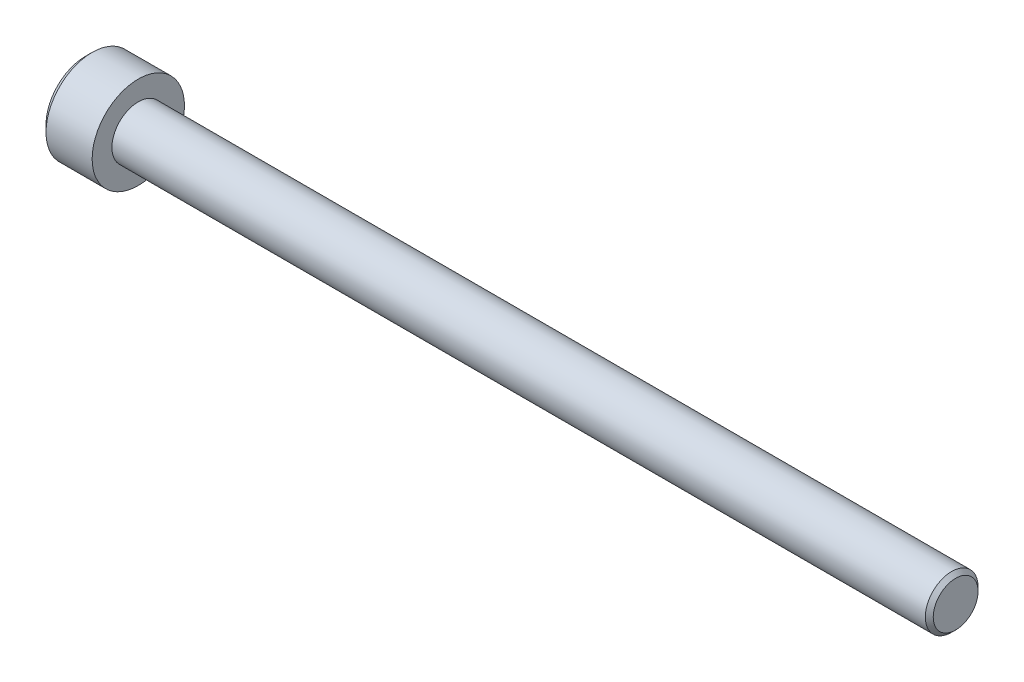
ISO-10303-21;
HEADER;
FILE_DESCRIPTION(('STEP AP214'),'2;1');
FILE_NAME('part.step','',(''),(''),'','','');
FILE_SCHEMA(('AUTOMOTIVE_DESIGN { 1 0 10303 214 1 1 1 1 }'));
ENDSEC;
DATA;
#1=APPLICATION_CONTEXT('core data for automotive mechanical design processes');
#2=APPLICATION_PROTOCOL_DEFINITION('international standard','automotive_design',2000,#1);
#3=PRODUCT_CONTEXT('',#1,'mechanical');
#4=PRODUCT('Part','Part','',(#3));
#5=PRODUCT_RELATED_PRODUCT_CATEGORY('part','',(#4));
#6=PRODUCT_DEFINITION_FORMATION('','',#4);
#7=PRODUCT_DEFINITION_CONTEXT('part definition',#1,'design');
#8=PRODUCT_DEFINITION('design','',#6,#7);
#9=PRODUCT_DEFINITION_SHAPE('','',#8);
#10=(LENGTH_UNIT() NAMED_UNIT(*) SI_UNIT(.MILLI.,.METRE.));
#11=(NAMED_UNIT(*) PLANE_ANGLE_UNIT() SI_UNIT($,.RADIAN.));
#12=(NAMED_UNIT(*) SI_UNIT($,.STERADIAN.) SOLID_ANGLE_UNIT());
#13=UNCERTAINTY_MEASURE_WITH_UNIT(LENGTH_MEASURE(1.E-05),#10,'distance_accuracy_value','');
#14=(GEOMETRIC_REPRESENTATION_CONTEXT(3) GLOBAL_UNCERTAINTY_ASSIGNED_CONTEXT((#13)) GLOBAL_UNIT_ASSIGNED_CONTEXT((#10,
#11,#12)) REPRESENTATION_CONTEXT('',''));
#15=CARTESIAN_POINT('',(0.,0.,0.));
#16=DIRECTION('',(0.,0.,1.));
#17=DIRECTION('',(1.,0.,0.));
#18=AXIS2_PLACEMENT_3D('',#15,#16,#17);
#19=CARTESIAN_POINT('',(0.,0.,0.));
#20=DIRECTION('',(1.,0.,0.));
#21=DIRECTION('',(0.,0.,-1.));
#22=AXIS2_PLACEMENT_3D('',#19,#20,#21);
#23=PLANE('',#22);
#24=CARTESIAN_POINT('',(0.,0.,0.));
#25=DIRECTION('',(1.,0.,0.));
#26=DIRECTION('',(0.,0.,-1.));
#27=AXIS2_PLACEMENT_3D('',#24,#25,#26);
#28=CIRCLE('',#27,3.);
#29=CARTESIAN_POINT('',(0.,0.,-3.));
#30=VERTEX_POINT('',#29);
#31=EDGE_CURVE('E53',#30,#30,#28,.F.);
#32=ORIENTED_EDGE('',*,*,#31,.T.);
#33=EDGE_LOOP('',(#32));
#34=FACE_BOUND('',#33,.T.);
#35=DIRECTION('',(0.,-0.5,-0.866025403784439));
#36=VECTOR('',#35,1.);
#37=CARTESIAN_POINT('',(0.,2.,0.));
#38=LINE('',#37,#36);
#39=CARTESIAN_POINT('',(0.,2.,0.));
#40=VERTEX_POINT('',#39);
#41=CARTESIAN_POINT('',(0.,1.,-1.73205080756888));
#42=VERTEX_POINT('',#41);
#43=EDGE_CURVE('E140',#40,#42,#38,.T.);
#44=ORIENTED_EDGE('',*,*,#43,.F.);
#45=DIRECTION('',(0.,0.5,-0.866025403784439));
#46=VECTOR('',#45,1.);
#47=CARTESIAN_POINT('',(0.,1.,1.73205080756888));
#48=LINE('',#47,#46);
#49=CARTESIAN_POINT('',(0.,1.,1.73205080756888));
#50=VERTEX_POINT('',#49);
#51=EDGE_CURVE('E60',#50,#40,#48,.T.);
#52=ORIENTED_EDGE('',*,*,#51,.F.);
#53=DIRECTION('',(0.,1.,0.));
#54=VECTOR('',#53,1.);
#55=CARTESIAN_POINT('',(0.,-1.,1.73205080756888));
#56=LINE('',#55,#54);
#57=CARTESIAN_POINT('',(0.,-1.,1.73205080756888));
#58=VERTEX_POINT('',#57);
#59=EDGE_CURVE('E153',#58,#50,#56,.T.);
#60=ORIENTED_EDGE('',*,*,#59,.F.);
#61=DIRECTION('',(0.,0.5,0.866025403784439));
#62=VECTOR('',#61,1.);
#63=CARTESIAN_POINT('',(0.,-2.,0.));
#64=LINE('',#63,#62);
#65=CARTESIAN_POINT('',(0.,-2.,0.));
#66=VERTEX_POINT('',#65);
#67=EDGE_CURVE('E150',#66,#58,#64,.T.);
#68=ORIENTED_EDGE('',*,*,#67,.F.);
#69=DIRECTION('',(0.,-0.5,0.866025403784439));
#70=VECTOR('',#69,1.);
#71=CARTESIAN_POINT('',(0.,-1.,-1.73205080756888));
#72=LINE('',#71,#70);
#73=CARTESIAN_POINT('',(0.,-1.,-1.73205080756888));
#74=VERTEX_POINT('',#73);
#75=EDGE_CURVE('E108',#74,#66,#72,.T.);
#76=ORIENTED_EDGE('',*,*,#75,.F.);
#77=DIRECTION('',(0.,-1.,0.));
#78=VECTOR('',#77,1.);
#79=CARTESIAN_POINT('',(0.,1.,-1.73205080756888));
#80=LINE('',#79,#78);
#81=EDGE_CURVE('E144',#42,#74,#80,.T.);
#82=ORIENTED_EDGE('',*,*,#81,.F.);
#83=EDGE_LOOP('',(#44,#52,#60,#68,#76,#82));
#84=FACE_BOUND('',#83,.T.);
#85=ADVANCED_FACE('F43',(#34,#84),#23,.F.);
#86=CARTESIAN_POINT('',(0.,0.,0.));
#87=DIRECTION('',(-1.,0.,0.));
#88=DIRECTION('',(0.,0.,1.));
#89=AXIS2_PLACEMENT_3D('',#86,#87,#88);
#90=CYLINDRICAL_SURFACE('',#89,3.5);
#91=CARTESIAN_POINT('',(0.50000000000001,0.,0.));
#92=DIRECTION('',(1.,0.,0.));
#93=DIRECTION('',(0.,0.,-1.));
#94=AXIS2_PLACEMENT_3D('',#91,#92,#93);
#95=CIRCLE('',#94,3.5);
#96=CARTESIAN_POINT('',(0.50000000000001,0.,-3.5));
#97=VERTEX_POINT('',#96);
#98=EDGE_CURVE('E11',#97,#97,#95,.T.);
#99=ORIENTED_EDGE('',*,*,#98,.T.);
#100=EDGE_LOOP('',(#99));
#101=FACE_BOUND('',#100,.T.);
#102=CARTESIAN_POINT('',(4.,0.,0.));
#103=DIRECTION('',(-1.,0.,0.));
#104=DIRECTION('',(0.,0.,1.));
#105=AXIS2_PLACEMENT_3D('',#102,#103,#104);
#106=CIRCLE('',#105,3.5);
#107=CARTESIAN_POINT('',(4.,0.,3.5));
#108=VERTEX_POINT('',#107);
#109=EDGE_CURVE('E172',#108,#108,#106,.T.);
#110=ORIENTED_EDGE('',*,*,#109,.T.);
#111=EDGE_LOOP('',(#110));
#112=FACE_BOUND('',#111,.T.);
#113=ADVANCED_FACE('F198',(#101,#112),#90,.T.);
#114=CARTESIAN_POINT('',(4.,3.5,0.));
#115=DIRECTION('',(-1.,0.,0.));
#116=DIRECTION('',(0.,0.,1.));
#117=AXIS2_PLACEMENT_3D('',#114,#115,#116);
#118=PLANE('',#117);
#119=ORIENTED_EDGE('',*,*,#109,.F.);
#120=EDGE_LOOP('',(#119));
#121=FACE_BOUND('',#120,.T.);
#122=CARTESIAN_POINT('',(4.,0.,0.));
#123=DIRECTION('',(-1.,0.,0.));
#124=DIRECTION('',(0.,0.,1.));
#125=AXIS2_PLACEMENT_3D('',#122,#123,#124);
#126=CIRCLE('',#125,2.);
#127=CARTESIAN_POINT('',(4.,0.,2.));
#128=VERTEX_POINT('',#127);
#129=EDGE_CURVE('E159',#128,#128,#126,.T.);
#130=ORIENTED_EDGE('',*,*,#129,.T.);
#131=EDGE_LOOP('',(#130));
#132=FACE_BOUND('',#131,.T.);
#133=ADVANCED_FACE('F203',(#121,#132),#118,.F.);
#134=CARTESIAN_POINT('',(0.,0.,0.));
#135=DIRECTION('',(-1.,0.,0.));
#136=DIRECTION('',(0.,0.,1.));
#137=AXIS2_PLACEMENT_3D('',#134,#135,#136);
#138=CYLINDRICAL_SURFACE('',#137,2.);
#139=CARTESIAN_POINT('',(65.7,0.,0.));
#140=DIRECTION('',(-1.,0.,0.));
#141=DIRECTION('',(0.,0.,1.));
#142=AXIS2_PLACEMENT_3D('',#139,#140,#141);
#143=CIRCLE('',#142,2.);
#144=CARTESIAN_POINT('',(65.7,0.,2.));
#145=VERTEX_POINT('',#144);
#146=EDGE_CURVE('E176',#145,#145,#143,.T.);
#147=ORIENTED_EDGE('',*,*,#146,.T.);
#148=EDGE_LOOP('',(#147));
#149=FACE_BOUND('',#148,.T.);
#150=ORIENTED_EDGE('',*,*,#129,.F.);
#151=EDGE_LOOP('',(#150));
#152=FACE_BOUND('',#151,.T.);
#153=ADVANCED_FACE('F221',(#149,#152),#138,.T.);
#154=CARTESIAN_POINT('',(66.,2.,0.));
#155=DIRECTION('',(-1.,0.,0.));
#156=DIRECTION('',(0.,0.,1.));
#157=AXIS2_PLACEMENT_3D('',#154,#155,#156);
#158=PLANE('',#157);
#159=CARTESIAN_POINT('',(66.,0.,0.));
#160=DIRECTION('',(-1.,0.,0.));
#161=DIRECTION('',(0.,0.,1.));
#162=AXIS2_PLACEMENT_3D('',#159,#160,#161);
#163=CIRCLE('',#162,1.70000000000001);
#164=CARTESIAN_POINT('',(66.,0.,1.70000000000001));
#165=VERTEX_POINT('',#164);
#166=EDGE_CURVE('E180',#165,#165,#163,.F.);
#167=ORIENTED_EDGE('',*,*,#166,.T.);
#168=EDGE_LOOP('',(#167));
#169=FACE_BOUND('',#168,.T.);
#170=ADVANCED_FACE('F213',(#169),#158,.F.);
#171=CARTESIAN_POINT('',(65.7,0.,0.));
#172=DIRECTION('',(-1.,0.,0.));
#173=DIRECTION('',(0.,0.,1.));
#174=AXIS2_PLACEMENT_3D('',#171,#172,#173);
#175=CONICAL_SURFACE('',#174,2.,0.785398163397457);
#176=ORIENTED_EDGE('',*,*,#166,.F.);
#177=EDGE_LOOP('',(#176));
#178=FACE_BOUND('',#177,.T.);
#179=ORIENTED_EDGE('',*,*,#146,.F.);
#180=EDGE_LOOP('',(#179));
#181=FACE_BOUND('',#180,.T.);
#182=ADVANCED_FACE('F208',(#178,#181),#175,.T.);
#183=CARTESIAN_POINT('',(1.,1.,1.73205080756888));
#184=DIRECTION('',(0.,0.866025403784439,0.5));
#185=DIRECTION('',(0.,-0.5,0.866025403784439));
#186=AXIS2_PLACEMENT_3D('',#183,#184,#185);
#187=PLANE('',#186);
#188=ORIENTED_EDGE('',*,*,#51,.T.);
#189=DIRECTION('',(-1.,0.,0.));
#190=VECTOR('',#189,1.);
#191=CARTESIAN_POINT('',(1.,2.,0.));
#192=LINE('',#191,#190);
#193=CARTESIAN_POINT('',(1.,2.,0.));
#194=VERTEX_POINT('',#193);
#195=EDGE_CURVE('E90',#194,#40,#192,.T.);
#196=ORIENTED_EDGE('',*,*,#195,.F.);
#197=DIRECTION('',(0.,0.5,-0.866025403784439));
#198=VECTOR('',#197,1.);
#199=CARTESIAN_POINT('',(1.,1.,1.73205080756888));
#200=LINE('',#199,#198);
#201=CARTESIAN_POINT('',(1.,1.,1.73205080756888));
#202=VERTEX_POINT('',#201);
#203=EDGE_CURVE('E156',#202,#194,#200,.T.);
#204=ORIENTED_EDGE('',*,*,#203,.F.);
#205=DIRECTION('',(-1.,0.,0.));
#206=VECTOR('',#205,1.);
#207=CARTESIAN_POINT('',(1.,1.,1.73205080756888));
#208=LINE('',#207,#206);
#209=EDGE_CURVE('E68',#202,#50,#208,.T.);
#210=ORIENTED_EDGE('',*,*,#209,.T.);
#211=EDGE_LOOP('',(#188,#196,#204,#210));
#212=FACE_BOUND('',#211,.T.);
#213=ADVANCED_FACE('F212',(#212),#187,.F.);
#214=CARTESIAN_POINT('',(1.,-1.,1.73205080756888));
#215=DIRECTION('',(0.,0.,1.));
#216=DIRECTION('',(1.,0.,0.));
#217=AXIS2_PLACEMENT_3D('',#214,#215,#216);
#218=PLANE('',#217);
#219=ORIENTED_EDGE('',*,*,#59,.T.);
#220=ORIENTED_EDGE('',*,*,#209,.F.);
#221=DIRECTION('',(0.,1.,0.));
#222=VECTOR('',#221,1.);
#223=CARTESIAN_POINT('',(1.,-1.,1.73205080756888));
#224=LINE('',#223,#222);
#225=CARTESIAN_POINT('',(1.,-1.,1.73205080756888));
#226=VERTEX_POINT('',#225);
#227=EDGE_CURVE('E122',#226,#202,#224,.T.);
#228=ORIENTED_EDGE('',*,*,#227,.F.);
#229=DIRECTION('',(-1.,0.,0.));
#230=VECTOR('',#229,1.);
#231=CARTESIAN_POINT('',(1.,-1.,1.73205080756888));
#232=LINE('',#231,#230);
#233=EDGE_CURVE('E113',#226,#58,#232,.T.);
#234=ORIENTED_EDGE('',*,*,#233,.T.);
#235=EDGE_LOOP('',(#219,#220,#228,#234));
#236=FACE_BOUND('',#235,.T.);
#237=ADVANCED_FACE('F219',(#236),#218,.F.);
#238=CARTESIAN_POINT('',(1.,-2.,0.));
#239=DIRECTION('',(0.,-0.866025403784439,0.5));
#240=DIRECTION('',(0.,-0.5,-0.866025403784439));
#241=AXIS2_PLACEMENT_3D('',#238,#239,#240);
#242=PLANE('',#241);
#243=ORIENTED_EDGE('',*,*,#67,.T.);
#244=ORIENTED_EDGE('',*,*,#233,.F.);
#245=DIRECTION('',(0.,0.5,0.866025403784439));
#246=VECTOR('',#245,1.);
#247=CARTESIAN_POINT('',(1.,-2.,0.));
#248=LINE('',#247,#246);
#249=CARTESIAN_POINT('',(1.,-2.,0.));
#250=VERTEX_POINT('',#249);
#251=EDGE_CURVE('E117',#250,#226,#248,.T.);
#252=ORIENTED_EDGE('',*,*,#251,.F.);
#253=DIRECTION('',(-1.,0.,0.));
#254=VECTOR('',#253,1.);
#255=CARTESIAN_POINT('',(1.,-2.,0.));
#256=LINE('',#255,#254);
#257=EDGE_CURVE('E101',#250,#66,#256,.T.);
#258=ORIENTED_EDGE('',*,*,#257,.T.);
#259=EDGE_LOOP('',(#243,#244,#252,#258));
#260=FACE_BOUND('',#259,.T.);
#261=ADVANCED_FACE('F118',(#260),#242,.F.);
#262=CARTESIAN_POINT('',(1.,-1.,-1.73205080756888));
#263=DIRECTION('',(0.,-0.866025403784439,-0.5));
#264=DIRECTION('',(0.,0.5,-0.866025403784439));
#265=AXIS2_PLACEMENT_3D('',#262,#263,#264);
#266=PLANE('',#265);
#267=ORIENTED_EDGE('',*,*,#75,.T.);
#268=ORIENTED_EDGE('',*,*,#257,.F.);
#269=DIRECTION('',(0.,-0.5,0.866025403784439));
#270=VECTOR('',#269,1.);
#271=CARTESIAN_POINT('',(1.,-1.,-1.73205080756888));
#272=LINE('',#271,#270);
#273=CARTESIAN_POINT('',(1.,-1.,-1.73205080756888));
#274=VERTEX_POINT('',#273);
#275=EDGE_CURVE('E105',#274,#250,#272,.T.);
#276=ORIENTED_EDGE('',*,*,#275,.F.);
#277=DIRECTION('',(-1.,0.,0.));
#278=VECTOR('',#277,1.);
#279=CARTESIAN_POINT('',(1.,-1.,-1.73205080756888));
#280=LINE('',#279,#278);
#281=EDGE_CURVE('E114',#274,#74,#280,.T.);
#282=ORIENTED_EDGE('',*,*,#281,.T.);
#283=EDGE_LOOP('',(#267,#268,#276,#282));
#284=FACE_BOUND('',#283,.T.);
#285=ADVANCED_FACE('F103',(#284),#266,.F.);
#286=CARTESIAN_POINT('',(1.,1.,-1.73205080756888));
#287=DIRECTION('',(0.,0.,-1.));
#288=DIRECTION('',(0.,1.,0.));
#289=AXIS2_PLACEMENT_3D('',#286,#287,#288);
#290=PLANE('',#289);
#291=ORIENTED_EDGE('',*,*,#81,.T.);
#292=ORIENTED_EDGE('',*,*,#281,.F.);
#293=DIRECTION('',(0.,-1.,0.));
#294=VECTOR('',#293,1.);
#295=CARTESIAN_POINT('',(1.,1.,-1.73205080756888));
#296=LINE('',#295,#294);
#297=CARTESIAN_POINT('',(1.,1.,-1.73205080756888));
#298=VERTEX_POINT('',#297);
#299=EDGE_CURVE('E128',#298,#274,#296,.T.);
#300=ORIENTED_EDGE('',*,*,#299,.F.);
#301=DIRECTION('',(-1.,0.,0.));
#302=VECTOR('',#301,1.);
#303=CARTESIAN_POINT('',(1.,1.,-1.73205080756888));
#304=LINE('',#303,#302);
#305=EDGE_CURVE('E164',#298,#42,#304,.T.);
#306=ORIENTED_EDGE('',*,*,#305,.T.);
#307=EDGE_LOOP('',(#291,#292,#300,#306));
#308=FACE_BOUND('',#307,.T.);
#309=ADVANCED_FACE('F241',(#308),#290,.F.);
#310=CARTESIAN_POINT('',(1.,2.,0.));
#311=DIRECTION('',(0.,0.866025403784439,-0.5));
#312=DIRECTION('',(0.,0.5,0.866025403784439));
#313=AXIS2_PLACEMENT_3D('',#310,#311,#312);
#314=PLANE('',#313);
#315=ORIENTED_EDGE('',*,*,#43,.T.);
#316=ORIENTED_EDGE('',*,*,#305,.F.);
#317=DIRECTION('',(0.,-0.5,-0.866025403784439));
#318=VECTOR('',#317,1.);
#319=CARTESIAN_POINT('',(1.,2.,0.));
#320=LINE('',#319,#318);
#321=EDGE_CURVE('E132',#194,#298,#320,.T.);
#322=ORIENTED_EDGE('',*,*,#321,.F.);
#323=ORIENTED_EDGE('',*,*,#195,.T.);
#324=EDGE_LOOP('',(#315,#316,#322,#323));
#325=FACE_BOUND('',#324,.T.);
#326=ADVANCED_FACE('F194',(#325),#314,.F.);
#327=CARTESIAN_POINT('',(1.,0.,0.));
#328=DIRECTION('',(-1.,0.,0.));
#329=DIRECTION('',(0.,0.,1.));
#330=AXIS2_PLACEMENT_3D('',#327,#328,#329);
#331=PLANE('',#330);
#332=ORIENTED_EDGE('',*,*,#203,.T.);
#333=ORIENTED_EDGE('',*,*,#321,.T.);
#334=ORIENTED_EDGE('',*,*,#299,.T.);
#335=ORIENTED_EDGE('',*,*,#275,.T.);
#336=ORIENTED_EDGE('',*,*,#251,.T.);
#337=ORIENTED_EDGE('',*,*,#227,.T.);
#338=EDGE_LOOP('',(#332,#333,#334,#335,#336,#337));
#339=FACE_BOUND('',#338,.T.);
#340=ADVANCED_FACE('F125',(#339),#331,.T.);
#341=CARTESIAN_POINT('',(0.,0.,0.));
#342=DIRECTION('',(1.,0.,0.));
#343=DIRECTION('',(0.,0.,-1.));
#344=AXIS2_PLACEMENT_3D('',#341,#342,#343);
#345=CONICAL_SURFACE('',#344,3.,0.785398163397443);
#346=ORIENTED_EDGE('',*,*,#98,.F.);
#347=EDGE_LOOP('',(#346));
#348=FACE_BOUND('',#347,.T.);
#349=ORIENTED_EDGE('',*,*,#31,.F.);
#350=EDGE_LOOP('',(#349));
#351=FACE_BOUND('',#350,.T.);
#352=ADVANCED_FACE('F46',(#348,#351),#345,.T.);
#353=CLOSED_SHELL('',(#85,#113,#133,#153,#170,#182,#213,#237,#261,#285,#309,#326,#340,#352));
#354=MANIFOLD_SOLID_BREP('B2',#353);
#355=ADVANCED_BREP_SHAPE_REPRESENTATION('',(#18,#354),#14);
#356=SHAPE_DEFINITION_REPRESENTATION(#9,#355);
ENDSEC;
END-ISO-10303-21;
